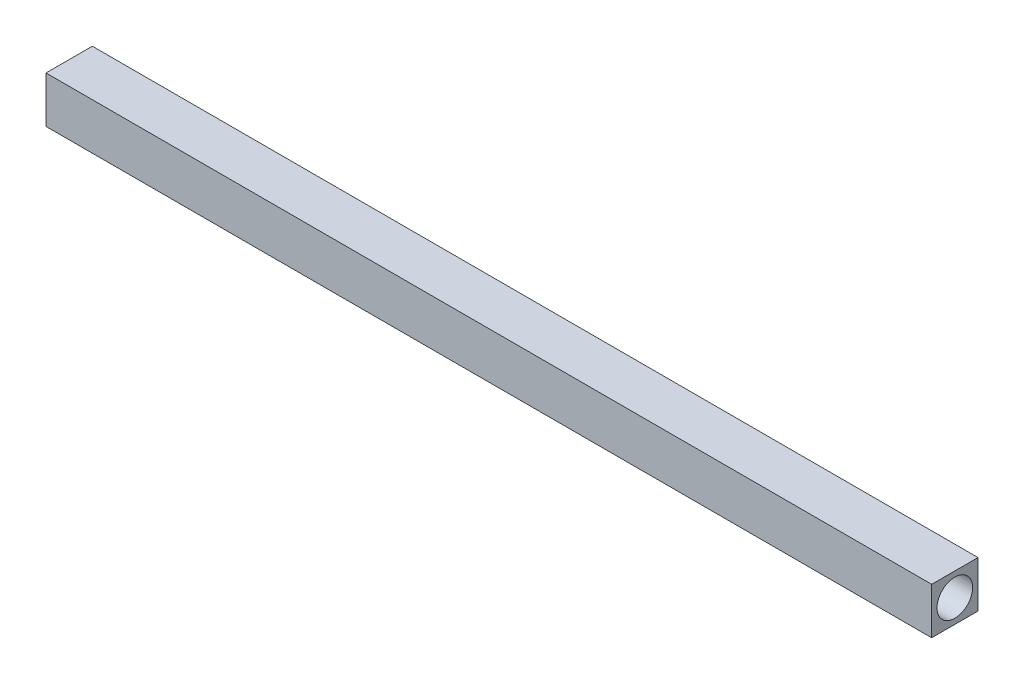
ISO-10303-21;
HEADER;
FILE_DESCRIPTION(('STEP AP214'),'2;1');
FILE_NAME('part.step','',(''),(''),'','','');
FILE_SCHEMA(('AUTOMOTIVE_DESIGN { 1 0 10303 214 1 1 1 1 }'));
ENDSEC;
DATA;
#1=APPLICATION_CONTEXT('core data for automotive mechanical design processes');
#2=APPLICATION_PROTOCOL_DEFINITION('international standard','automotive_design',2000,#1);
#3=PRODUCT_CONTEXT('',#1,'mechanical');
#4=PRODUCT('Part','Part','',(#3));
#5=PRODUCT_RELATED_PRODUCT_CATEGORY('part','',(#4));
#6=PRODUCT_DEFINITION_FORMATION('','',#4);
#7=PRODUCT_DEFINITION_CONTEXT('part definition',#1,'design');
#8=PRODUCT_DEFINITION('design','',#6,#7);
#9=PRODUCT_DEFINITION_SHAPE('','',#8);
#10=(LENGTH_UNIT() NAMED_UNIT(*) SI_UNIT(.MILLI.,.METRE.));
#11=(NAMED_UNIT(*) PLANE_ANGLE_UNIT() SI_UNIT($,.RADIAN.));
#12=(NAMED_UNIT(*) SI_UNIT($,.STERADIAN.) SOLID_ANGLE_UNIT());
#13=UNCERTAINTY_MEASURE_WITH_UNIT(LENGTH_MEASURE(1.E-05),#10,'distance_accuracy_value','');
#14=(GEOMETRIC_REPRESENTATION_CONTEXT(3) GLOBAL_UNCERTAINTY_ASSIGNED_CONTEXT((#13)) GLOBAL_UNIT_ASSIGNED_CONTEXT((#10,
#11,#12)) REPRESENTATION_CONTEXT('',''));
#15=CARTESIAN_POINT('',(0.,0.,0.));
#16=DIRECTION('',(0.,0.,1.));
#17=DIRECTION('',(1.,0.,0.));
#18=AXIS2_PLACEMENT_3D('',#15,#16,#17);
#19=CARTESIAN_POINT('',(31.5595,1.651,-1.651));
#20=DIRECTION('',(0.,0.,1.));
#21=DIRECTION('',(0.,-1.,0.));
#22=AXIS2_PLACEMENT_3D('',#19,#20,#21);
#23=PLANE('',#22);
#24=DIRECTION('',(0.,1.,0.));
#25=VECTOR('',#24,1.);
#26=CARTESIAN_POINT('',(-31.5595,1.651,-1.651));
#27=LINE('',#26,#25);
#28=CARTESIAN_POINT('',(-31.5595,-1.651,-1.651));
#29=VERTEX_POINT('',#28);
#30=CARTESIAN_POINT('',(-31.5595,1.651,-1.651));
#31=VERTEX_POINT('',#30);
#32=EDGE_CURVE('E98',#29,#31,#27,.T.);
#33=ORIENTED_EDGE('',*,*,#32,.T.);
#34=DIRECTION('',(-1.,0.,0.));
#35=VECTOR('',#34,1.);
#36=CARTESIAN_POINT('',(31.5595,1.651,-1.651));
#37=LINE('',#36,#35);
#38=CARTESIAN_POINT('',(31.5595,1.651,-1.651));
#39=VERTEX_POINT('',#38);
#40=EDGE_CURVE('E11',#39,#31,#37,.T.);
#41=ORIENTED_EDGE('',*,*,#40,.F.);
#42=DIRECTION('',(0.,1.,0.));
#43=VECTOR('',#42,1.);
#44=CARTESIAN_POINT('',(31.5595,1.651,-1.651));
#45=LINE('',#44,#43);
#46=CARTESIAN_POINT('',(31.5595,-1.651,-1.651));
#47=VERTEX_POINT('',#46);
#48=EDGE_CURVE('E86',#47,#39,#45,.T.);
#49=ORIENTED_EDGE('',*,*,#48,.F.);
#50=DIRECTION('',(-1.,0.,0.));
#51=VECTOR('',#50,1.);
#52=CARTESIAN_POINT('',(31.5595,-1.651,-1.651));
#53=LINE('',#52,#51);
#54=EDGE_CURVE('E94',#47,#29,#53,.T.);
#55=ORIENTED_EDGE('',*,*,#54,.T.);
#56=EDGE_LOOP('',(#33,#41,#49,#55));
#57=FACE_BOUND('',#56,.T.);
#58=ADVANCED_FACE('F35',(#57),#23,.F.);
#59=CARTESIAN_POINT('',(31.5595,1.651,1.651));
#60=DIRECTION('',(0.,-1.,0.));
#61=DIRECTION('',(0.,0.,-1.));
#62=AXIS2_PLACEMENT_3D('',#59,#60,#61);
#63=PLANE('',#62);
#64=DIRECTION('',(0.,0.,1.));
#65=VECTOR('',#64,1.);
#66=CARTESIAN_POINT('',(-31.5595,1.651,1.651));
#67=LINE('',#66,#65);
#68=CARTESIAN_POINT('',(-31.5595,1.651,1.651));
#69=VERTEX_POINT('',#68);
#70=EDGE_CURVE('E90',#31,#69,#67,.T.);
#71=ORIENTED_EDGE('',*,*,#70,.T.);
#72=DIRECTION('',(-1.,0.,0.));
#73=VECTOR('',#72,1.);
#74=CARTESIAN_POINT('',(31.5595,1.651,1.651));
#75=LINE('',#74,#73);
#76=CARTESIAN_POINT('',(31.5595,1.651,1.651));
#77=VERTEX_POINT('',#76);
#78=EDGE_CURVE('E43',#77,#69,#75,.T.);
#79=ORIENTED_EDGE('',*,*,#78,.F.);
#80=DIRECTION('',(0.,0.,1.));
#81=VECTOR('',#80,1.);
#82=CARTESIAN_POINT('',(31.5595,1.651,1.651));
#83=LINE('',#82,#81);
#84=EDGE_CURVE('E81',#39,#77,#83,.T.);
#85=ORIENTED_EDGE('',*,*,#84,.F.);
#86=ORIENTED_EDGE('',*,*,#40,.T.);
#87=EDGE_LOOP('',(#71,#79,#85,#86));
#88=FACE_BOUND('',#87,.T.);
#89=ADVANCED_FACE('F89',(#88),#63,.F.);
#90=CARTESIAN_POINT('',(31.5595,1.651,1.651));
#91=DIRECTION('',(0.,0.,-1.));
#92=DIRECTION('',(0.,1.,0.));
#93=AXIS2_PLACEMENT_3D('',#90,#91,#92);
#94=PLANE('',#93);
#95=DIRECTION('',(0.,-1.,0.));
#96=VECTOR('',#95,1.);
#97=CARTESIAN_POINT('',(-31.5595,1.651,1.651));
#98=LINE('',#97,#96);
#99=CARTESIAN_POINT('',(-31.5595,-1.651,1.651));
#100=VERTEX_POINT('',#99);
#101=EDGE_CURVE('E68',#69,#100,#98,.T.);
#102=ORIENTED_EDGE('',*,*,#101,.T.);
#103=DIRECTION('',(-1.,0.,0.));
#104=VECTOR('',#103,1.);
#105=CARTESIAN_POINT('',(31.5595,-1.651,1.651));
#106=LINE('',#105,#104);
#107=CARTESIAN_POINT('',(31.5595,-1.651,1.651));
#108=VERTEX_POINT('',#107);
#109=EDGE_CURVE('E91',#108,#100,#106,.T.);
#110=ORIENTED_EDGE('',*,*,#109,.F.);
#111=DIRECTION('',(0.,-1.,0.));
#112=VECTOR('',#111,1.);
#113=CARTESIAN_POINT('',(31.5595,1.651,1.651));
#114=LINE('',#113,#112);
#115=EDGE_CURVE('E84',#77,#108,#114,.T.);
#116=ORIENTED_EDGE('',*,*,#115,.F.);
#117=ORIENTED_EDGE('',*,*,#78,.T.);
#118=EDGE_LOOP('',(#102,#110,#116,#117));
#119=FACE_BOUND('',#118,.T.);
#120=ADVANCED_FACE('F92',(#119),#94,.F.);
#121=CARTESIAN_POINT('',(31.5595,-1.651,1.651));
#122=DIRECTION('',(0.,1.,0.));
#123=DIRECTION('',(0.,0.,1.));
#124=AXIS2_PLACEMENT_3D('',#121,#122,#123);
#125=PLANE('',#124);
#126=DIRECTION('',(0.,0.,-1.));
#127=VECTOR('',#126,1.);
#128=CARTESIAN_POINT('',(-31.5595,-1.651,1.651));
#129=LINE('',#128,#127);
#130=EDGE_CURVE('E74',#100,#29,#129,.T.);
#131=ORIENTED_EDGE('',*,*,#130,.T.);
#132=ORIENTED_EDGE('',*,*,#54,.F.);
#133=DIRECTION('',(0.,0.,-1.));
#134=VECTOR('',#133,1.);
#135=CARTESIAN_POINT('',(31.5595,-1.651,1.651));
#136=LINE('',#135,#134);
#137=EDGE_CURVE('E51',#108,#47,#136,.T.);
#138=ORIENTED_EDGE('',*,*,#137,.F.);
#139=ORIENTED_EDGE('',*,*,#109,.T.);
#140=EDGE_LOOP('',(#131,#132,#138,#139));
#141=FACE_BOUND('',#140,.T.);
#142=ADVANCED_FACE('F106',(#141),#125,.F.);
#143=CARTESIAN_POINT('',(31.5595,0.,0.));
#144=DIRECTION('',(1.,0.,0.));
#145=DIRECTION('',(0.,0.,-1.));
#146=AXIS2_PLACEMENT_3D('',#143,#144,#145);
#147=PLANE('',#146);
#148=CARTESIAN_POINT('',(31.5595,0.,0.));
#149=DIRECTION('',(1.,0.,0.));
#150=DIRECTION('',(0.,0.,-1.));
#151=AXIS2_PLACEMENT_3D('',#148,#149,#150);
#152=CIRCLE('',#151,1.27);
#153=CARTESIAN_POINT('',(31.5595,0.,-1.27));
#154=VERTEX_POINT('',#153);
#155=EDGE_CURVE('E112',#154,#154,#152,.T.);
#156=ORIENTED_EDGE('',*,*,#155,.F.);
#157=EDGE_LOOP('',(#156));
#158=FACE_BOUND('',#157,.T.);
#159=ORIENTED_EDGE('',*,*,#48,.T.);
#160=ORIENTED_EDGE('',*,*,#84,.T.);
#161=ORIENTED_EDGE('',*,*,#115,.T.);
#162=ORIENTED_EDGE('',*,*,#137,.T.);
#163=EDGE_LOOP('',(#159,#160,#161,#162));
#164=FACE_BOUND('',#163,.T.);
#165=ADVANCED_FACE('F82',(#158,#164),#147,.T.);
#166=CARTESIAN_POINT('',(-31.5595,0.,0.));
#167=DIRECTION('',(1.,0.,0.));
#168=DIRECTION('',(0.,0.,-1.));
#169=AXIS2_PLACEMENT_3D('',#166,#167,#168);
#170=PLANE('',#169);
#171=CARTESIAN_POINT('',(-31.5595,0.,0.));
#172=DIRECTION('',(1.,0.,0.));
#173=DIRECTION('',(0.,0.,-1.));
#174=AXIS2_PLACEMENT_3D('',#171,#172,#173);
#175=CIRCLE('',#174,1.27);
#176=CARTESIAN_POINT('',(-31.5595,0.,-1.27));
#177=VERTEX_POINT('',#176);
#178=EDGE_CURVE('E118',#177,#177,#175,.T.);
#179=ORIENTED_EDGE('',*,*,#178,.T.);
#180=EDGE_LOOP('',(#179));
#181=FACE_BOUND('',#180,.T.);
#182=ORIENTED_EDGE('',*,*,#32,.F.);
#183=ORIENTED_EDGE('',*,*,#130,.F.);
#184=ORIENTED_EDGE('',*,*,#101,.F.);
#185=ORIENTED_EDGE('',*,*,#70,.F.);
#186=EDGE_LOOP('',(#182,#183,#184,#185));
#187=FACE_BOUND('',#186,.T.);
#188=ADVANCED_FACE('F109',(#181,#187),#170,.F.);
#189=CARTESIAN_POINT('',(28.3845,0.,0.));
#190=DIRECTION('',(1.,0.,0.));
#191=DIRECTION('',(0.,0.,-1.));
#192=AXIS2_PLACEMENT_3D('',#189,#190,#191);
#193=CYLINDRICAL_SURFACE('',#192,1.27);
#194=CARTESIAN_POINT('',(28.3845,0.,0.));
#195=DIRECTION('',(1.,0.,0.));
#196=DIRECTION('',(0.,0.,-1.));
#197=AXIS2_PLACEMENT_3D('',#194,#195,#196);
#198=CIRCLE('',#197,1.27);
#199=CARTESIAN_POINT('',(28.3845,0.,-1.27));
#200=VERTEX_POINT('',#199);
#201=EDGE_CURVE('E101',#200,#200,#198,.T.);
#202=ORIENTED_EDGE('',*,*,#201,.F.);
#203=EDGE_LOOP('',(#202));
#204=FACE_BOUND('',#203,.T.);
#205=ORIENTED_EDGE('',*,*,#155,.T.);
#206=EDGE_LOOP('',(#205));
#207=FACE_BOUND('',#206,.T.);
#208=ADVANCED_FACE('F148',(#204,#207),#193,.F.);
#209=CARTESIAN_POINT('',(28.3845,0.,0.));
#210=DIRECTION('',(1.,0.,0.));
#211=DIRECTION('',(0.,0.,-1.));
#212=AXIS2_PLACEMENT_3D('',#209,#210,#211);
#213=PLANE('',#212);
#214=ORIENTED_EDGE('',*,*,#201,.T.);
#215=EDGE_LOOP('',(#214));
#216=FACE_BOUND('',#215,.T.);
#217=ADVANCED_FACE('F133',(#216),#213,.T.);
#218=CARTESIAN_POINT('',(-28.3845,0.,0.));
#219=DIRECTION('',(-1.,0.,0.));
#220=DIRECTION('',(0.,0.,1.));
#221=AXIS2_PLACEMENT_3D('',#218,#219,#220);
#222=CYLINDRICAL_SURFACE('',#221,1.27);
#223=CARTESIAN_POINT('',(-28.3845,0.,0.));
#224=DIRECTION('',(1.,0.,0.));
#225=DIRECTION('',(0.,0.,-1.));
#226=AXIS2_PLACEMENT_3D('',#223,#224,#225);
#227=CIRCLE('',#226,1.27);
#228=CARTESIAN_POINT('',(-28.3845,0.,-1.27));
#229=VERTEX_POINT('',#228);
#230=EDGE_CURVE('E115',#229,#229,#227,.T.);
#231=ORIENTED_EDGE('',*,*,#230,.T.);
#232=EDGE_LOOP('',(#231));
#233=FACE_BOUND('',#232,.T.);
#234=ORIENTED_EDGE('',*,*,#178,.F.);
#235=EDGE_LOOP('',(#234));
#236=FACE_BOUND('',#235,.T.);
#237=ADVANCED_FACE('F124',(#233,#236),#222,.F.);
#238=CARTESIAN_POINT('',(-28.3845,0.,0.));
#239=DIRECTION('',(-1.,0.,0.));
#240=DIRECTION('',(0.,0.,-1.));
#241=AXIS2_PLACEMENT_3D('',#238,#239,#240);
#242=PLANE('',#241);
#243=ORIENTED_EDGE('',*,*,#230,.F.);
#244=EDGE_LOOP('',(#243));
#245=FACE_BOUND('',#244,.T.);
#246=ADVANCED_FACE('F127',(#245),#242,.T.);
#247=CLOSED_SHELL('',(#58,#89,#120,#142,#165,#188,#208,#217,#237,#246));
#248=MANIFOLD_SOLID_BREP('B2',#247);
#249=ADVANCED_BREP_SHAPE_REPRESENTATION('',(#18,#248),#14);
#250=SHAPE_DEFINITION_REPRESENTATION(#9,#249);
ENDSEC;
END-ISO-10303-21;
